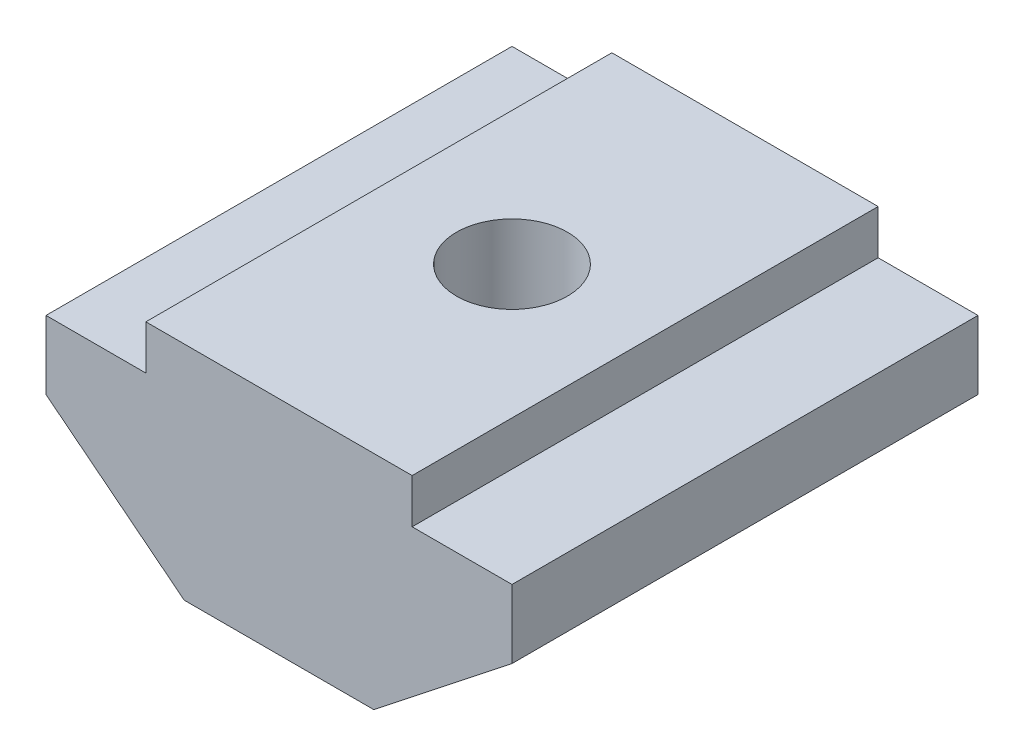
ISO-10303-21;
HEADER;
FILE_DESCRIPTION(('STEP AP214'),'2;1');
FILE_NAME('part.step','',(''),(''),'','','');
FILE_SCHEMA(('AUTOMOTIVE_DESIGN { 1 0 10303 214 1 1 1 1 }'));
ENDSEC;
DATA;
#1=APPLICATION_CONTEXT('core data for automotive mechanical design processes');
#2=APPLICATION_PROTOCOL_DEFINITION('international standard','automotive_design',2000,#1);
#3=PRODUCT_CONTEXT('',#1,'mechanical');
#4=PRODUCT('Part','Part','',(#3));
#5=PRODUCT_RELATED_PRODUCT_CATEGORY('part','',(#4));
#6=PRODUCT_DEFINITION_FORMATION('','',#4);
#7=PRODUCT_DEFINITION_CONTEXT('part definition',#1,'design');
#8=PRODUCT_DEFINITION('design','',#6,#7);
#9=PRODUCT_DEFINITION_SHAPE('','',#8);
#10=(LENGTH_UNIT() NAMED_UNIT(*) SI_UNIT(.MILLI.,.METRE.));
#11=(NAMED_UNIT(*) PLANE_ANGLE_UNIT() SI_UNIT($,.RADIAN.));
#12=(NAMED_UNIT(*) SI_UNIT($,.STERADIAN.) SOLID_ANGLE_UNIT());
#13=UNCERTAINTY_MEASURE_WITH_UNIT(LENGTH_MEASURE(1.E-05),#10,'distance_accuracy_value','');
#14=(GEOMETRIC_REPRESENTATION_CONTEXT(3) GLOBAL_UNCERTAINTY_ASSIGNED_CONTEXT((#13)) GLOBAL_UNIT_ASSIGNED_CONTEXT((#10,
#11,#12)) REPRESENTATION_CONTEXT('',''));
#15=CARTESIAN_POINT('',(0.,0.,0.));
#16=DIRECTION('',(0.,0.,1.));
#17=DIRECTION('',(1.,0.,0.));
#18=AXIS2_PLACEMENT_3D('',#15,#16,#17);
#19=CARTESIAN_POINT('',(3.,5.,10.5));
#20=DIRECTION('',(-1.,0.,0.));
#21=DIRECTION('',(0.,-1.,0.));
#22=AXIS2_PLACEMENT_3D('',#19,#20,#21);
#23=PLANE('',#22);
#24=DIRECTION('',(0.,1.,0.));
#25=VECTOR('',#24,1.);
#26=CARTESIAN_POINT('',(3.,5.,0.));
#27=LINE('',#26,#25);
#28=CARTESIAN_POINT('',(3.,4.,0.));
#29=VERTEX_POINT('',#28);
#30=CARTESIAN_POINT('',(3.,5.,0.));
#31=VERTEX_POINT('',#30);
#32=EDGE_CURVE('E177',#29,#31,#27,.T.);
#33=ORIENTED_EDGE('',*,*,#32,.T.);
#34=DIRECTION('',(0.,0.,-1.));
#35=VECTOR('',#34,1.);
#36=CARTESIAN_POINT('',(3.,5.,10.5));
#37=LINE('',#36,#35);
#38=CARTESIAN_POINT('',(3.,5.,10.5));
#39=VERTEX_POINT('',#38);
#40=EDGE_CURVE('E11',#39,#31,#37,.T.);
#41=ORIENTED_EDGE('',*,*,#40,.F.);
#42=DIRECTION('',(0.,1.,0.));
#43=VECTOR('',#42,1.);
#44=CARTESIAN_POINT('',(3.,5.,10.5));
#45=LINE('',#44,#43);
#46=CARTESIAN_POINT('',(3.,4.,10.5));
#47=VERTEX_POINT('',#46);
#48=EDGE_CURVE('E206',#47,#39,#45,.T.);
#49=ORIENTED_EDGE('',*,*,#48,.F.);
#50=DIRECTION('',(0.,0.,-1.));
#51=VECTOR('',#50,1.);
#52=CARTESIAN_POINT('',(3.,4.,10.5));
#53=LINE('',#52,#51);
#54=EDGE_CURVE('E173',#47,#29,#53,.T.);
#55=ORIENTED_EDGE('',*,*,#54,.T.);
#56=EDGE_LOOP('',(#33,#41,#49,#55));
#57=FACE_BOUND('',#56,.T.);
#58=ADVANCED_FACE('F44',(#57),#23,.F.);
#59=CARTESIAN_POINT('',(-3.,5.,10.5));
#60=DIRECTION('',(0.,-1.,0.));
#61=DIRECTION('',(0.,0.,-1.));
#62=AXIS2_PLACEMENT_3D('',#59,#60,#61);
#63=PLANE('',#62);
#64=CARTESIAN_POINT('',(0.,5.,5.24999999999998));
#65=DIRECTION('',(0.,1.,0.));
#66=DIRECTION('',(0.,0.,1.));
#67=AXIS2_PLACEMENT_3D('',#64,#65,#66);
#68=CIRCLE('',#67,1.25);
#69=CARTESIAN_POINT('',(0.,5.,6.49999999999998));
#70=VERTEX_POINT('',#69);
#71=EDGE_CURVE('E271',#70,#70,#68,.T.);
#72=ORIENTED_EDGE('',*,*,#71,.F.);
#73=EDGE_LOOP('',(#72));
#74=FACE_BOUND('',#73,.T.);
#75=DIRECTION('',(-1.,0.,0.));
#76=VECTOR('',#75,1.);
#77=CARTESIAN_POINT('',(-3.,5.,0.));
#78=LINE('',#77,#76);
#79=CARTESIAN_POINT('',(-3.,5.,0.));
#80=VERTEX_POINT('',#79);
#81=EDGE_CURVE('E181',#31,#80,#78,.T.);
#82=ORIENTED_EDGE('',*,*,#81,.T.);
#83=DIRECTION('',(0.,0.,-1.));
#84=VECTOR('',#83,1.);
#85=CARTESIAN_POINT('',(-3.,5.,10.5));
#86=LINE('',#85,#84);
#87=CARTESIAN_POINT('',(-3.,5.,10.5));
#88=VERTEX_POINT('',#87);
#89=EDGE_CURVE('E53',#88,#80,#86,.T.);
#90=ORIENTED_EDGE('',*,*,#89,.F.);
#91=DIRECTION('',(-1.,0.,0.));
#92=VECTOR('',#91,1.);
#93=CARTESIAN_POINT('',(-3.,5.,10.5));
#94=LINE('',#93,#92);
#95=EDGE_CURVE('E123',#39,#88,#94,.T.);
#96=ORIENTED_EDGE('',*,*,#95,.F.);
#97=ORIENTED_EDGE('',*,*,#40,.T.);
#98=EDGE_LOOP('',(#82,#90,#96,#97));
#99=FACE_BOUND('',#98,.T.);
#100=ADVANCED_FACE('F278',(#74,#99),#63,.F.);
#101=CARTESIAN_POINT('',(-3.,5.,10.5));
#102=DIRECTION('',(1.,0.,0.));
#103=DIRECTION('',(0.,1.,0.));
#104=AXIS2_PLACEMENT_3D('',#101,#102,#103);
#105=PLANE('',#104);
#106=DIRECTION('',(0.,-1.,0.));
#107=VECTOR('',#106,1.);
#108=CARTESIAN_POINT('',(-3.,5.,0.));
#109=LINE('',#108,#107);
#110=CARTESIAN_POINT('',(-3.,4.,0.));
#111=VERTEX_POINT('',#110);
#112=EDGE_CURVE('E185',#80,#111,#109,.T.);
#113=ORIENTED_EDGE('',*,*,#112,.T.);
#114=DIRECTION('',(0.,0.,-1.));
#115=VECTOR('',#114,1.);
#116=CARTESIAN_POINT('',(-3.,4.,10.5));
#117=LINE('',#116,#115);
#118=CARTESIAN_POINT('',(-3.,4.,10.5));
#119=VERTEX_POINT('',#118);
#120=EDGE_CURVE('E225',#119,#111,#117,.T.);
#121=ORIENTED_EDGE('',*,*,#120,.F.);
#122=DIRECTION('',(0.,-1.,0.));
#123=VECTOR('',#122,1.);
#124=CARTESIAN_POINT('',(-3.,5.,10.5));
#125=LINE('',#124,#123);
#126=EDGE_CURVE('E235',#88,#119,#125,.T.);
#127=ORIENTED_EDGE('',*,*,#126,.F.);
#128=ORIENTED_EDGE('',*,*,#89,.T.);
#129=EDGE_LOOP('',(#113,#121,#127,#128));
#130=FACE_BOUND('',#129,.T.);
#131=ADVANCED_FACE('F233',(#130),#105,.F.);
#132=CARTESIAN_POINT('',(-3.,4.,10.5));
#133=DIRECTION('',(0.,-1.,0.));
#134=DIRECTION('',(0.,0.,-1.));
#135=AXIS2_PLACEMENT_3D('',#132,#133,#134);
#136=PLANE('',#135);
#137=DIRECTION('',(-1.,0.,0.));
#138=VECTOR('',#137,1.);
#139=CARTESIAN_POINT('',(-3.,4.,0.));
#140=LINE('',#139,#138);
#141=CARTESIAN_POINT('',(-5.24999999999998,4.,0.));
#142=VERTEX_POINT('',#141);
#143=EDGE_CURVE('E188',#111,#142,#140,.T.);
#144=ORIENTED_EDGE('',*,*,#143,.T.);
#145=DIRECTION('',(0.,0.,-1.));
#146=VECTOR('',#145,1.);
#147=CARTESIAN_POINT('',(-5.24999999999998,4.,10.5));
#148=LINE('',#147,#146);
#149=CARTESIAN_POINT('',(-5.24999999999998,4.,10.5));
#150=VERTEX_POINT('',#149);
#151=EDGE_CURVE('E221',#150,#142,#148,.T.);
#152=ORIENTED_EDGE('',*,*,#151,.F.);
#153=DIRECTION('',(-1.,0.,0.));
#154=VECTOR('',#153,1.);
#155=CARTESIAN_POINT('',(-3.,4.,10.5));
#156=LINE('',#155,#154);
#157=EDGE_CURVE('E254',#119,#150,#156,.T.);
#158=ORIENTED_EDGE('',*,*,#157,.F.);
#159=ORIENTED_EDGE('',*,*,#120,.T.);
#160=EDGE_LOOP('',(#144,#152,#158,#159));
#161=FACE_BOUND('',#160,.T.);
#162=ADVANCED_FACE('F244',(#161),#136,.F.);
#163=CARTESIAN_POINT('',(-5.24999999999998,4.,10.5));
#164=DIRECTION('',(1.,0.,0.));
#165=DIRECTION('',(0.,0.,-1.));
#166=AXIS2_PLACEMENT_3D('',#163,#164,#165);
#167=PLANE('',#166);
#168=DIRECTION('',(0.,-1.,0.));
#169=VECTOR('',#168,1.);
#170=CARTESIAN_POINT('',(-5.24999999999998,4.,0.));
#171=LINE('',#170,#169);
#172=CARTESIAN_POINT('',(-5.24999999999998,2.45593869111821,0.));
#173=VERTEX_POINT('',#172);
#174=EDGE_CURVE('E191',#142,#173,#171,.T.);
#175=ORIENTED_EDGE('',*,*,#174,.T.);
#176=DIRECTION('',(0.,0.,-1.));
#177=VECTOR('',#176,1.);
#178=CARTESIAN_POINT('',(-5.24999999999998,2.45593869111821,10.5));
#179=LINE('',#178,#177);
#180=CARTESIAN_POINT('',(-5.24999999999998,2.45593869111821,10.5));
#181=VERTEX_POINT('',#180);
#182=EDGE_CURVE('E217',#181,#173,#179,.T.);
#183=ORIENTED_EDGE('',*,*,#182,.F.);
#184=DIRECTION('',(0.,-1.,0.));
#185=VECTOR('',#184,1.);
#186=CARTESIAN_POINT('',(-5.24999999999998,4.,10.5));
#187=LINE('',#186,#185);
#188=EDGE_CURVE('E250',#150,#181,#187,.T.);
#189=ORIENTED_EDGE('',*,*,#188,.F.);
#190=ORIENTED_EDGE('',*,*,#151,.T.);
#191=EDGE_LOOP('',(#175,#183,#189,#190));
#192=FACE_BOUND('',#191,.T.);
#193=ADVANCED_FACE('F248',(#192),#167,.F.);
#194=CARTESIAN_POINT('',(-5.24999999999998,2.45593869111821,10.5));
#195=DIRECTION('',(0.619208751305956,0.78522641467676,0.));
#196=DIRECTION('',(-0.78522641467676,0.619208751305956,0.));
#197=AXIS2_PLACEMENT_3D('',#194,#195,#196);
#198=PLANE('',#197);
#199=DIRECTION('',(0.78522641467676,-0.619208751305956,0.));
#200=VECTOR('',#199,1.);
#201=CARTESIAN_POINT('',(-5.24999999999998,2.45593869111821,0.));
#202=LINE('',#201,#200);
#203=CARTESIAN_POINT('',(-2.13559322033896,0.,0.));
#204=VERTEX_POINT('',#203);
#205=EDGE_CURVE('E194',#173,#204,#202,.T.);
#206=ORIENTED_EDGE('',*,*,#205,.T.);
#207=DIRECTION('',(0.,0.,-1.));
#208=VECTOR('',#207,1.);
#209=CARTESIAN_POINT('',(-2.13559322033896,0.,10.5));
#210=LINE('',#209,#208);
#211=CARTESIAN_POINT('',(-2.13559322033896,0.,10.5));
#212=VERTEX_POINT('',#211);
#213=EDGE_CURVE('E213',#212,#204,#210,.T.);
#214=ORIENTED_EDGE('',*,*,#213,.F.);
#215=DIRECTION('',(0.78522641467676,-0.619208751305956,0.));
#216=VECTOR('',#215,1.);
#217=CARTESIAN_POINT('',(-5.24999999999998,2.45593869111821,10.5));
#218=LINE('',#217,#216);
#219=EDGE_CURVE('E253',#181,#212,#218,.T.);
#220=ORIENTED_EDGE('',*,*,#219,.F.);
#221=ORIENTED_EDGE('',*,*,#182,.T.);
#222=EDGE_LOOP('',(#206,#214,#220,#221));
#223=FACE_BOUND('',#222,.T.);
#224=ADVANCED_FACE('F288',(#223),#198,.F.);
#225=CARTESIAN_POINT('',(2.13559322033896,0.,10.5));
#226=DIRECTION('',(0.,1.,0.));
#227=DIRECTION('',(0.,0.,1.));
#228=AXIS2_PLACEMENT_3D('',#225,#226,#227);
#229=PLANE('',#228);
#230=CARTESIAN_POINT('',(0.,0.,5.24999999999998));
#231=DIRECTION('',(0.,1.,0.));
#232=DIRECTION('',(0.,0.,1.));
#233=AXIS2_PLACEMENT_3D('',#230,#231,#232);
#234=CIRCLE('',#233,1.25);
#235=CARTESIAN_POINT('',(0.,0.,6.49999999999997));
#236=VERTEX_POINT('',#235);
#237=EDGE_CURVE('E182',#236,#236,#234,.T.);
#238=ORIENTED_EDGE('',*,*,#237,.T.);
#239=EDGE_LOOP('',(#238));
#240=FACE_BOUND('',#239,.T.);
#241=DIRECTION('',(1.,0.,0.));
#242=VECTOR('',#241,1.);
#243=CARTESIAN_POINT('',(2.13559322033896,0.,0.));
#244=LINE('',#243,#242);
#245=CARTESIAN_POINT('',(2.13559322033896,0.,0.));
#246=VERTEX_POINT('',#245);
#247=EDGE_CURVE('E197',#204,#246,#244,.T.);
#248=ORIENTED_EDGE('',*,*,#247,.T.);
#249=DIRECTION('',(0.,0.,-1.));
#250=VECTOR('',#249,1.);
#251=CARTESIAN_POINT('',(2.13559322033896,0.,10.5));
#252=LINE('',#251,#250);
#253=CARTESIAN_POINT('',(2.13559322033896,0.,10.5));
#254=VERTEX_POINT('',#253);
#255=EDGE_CURVE('E166',#254,#246,#252,.T.);
#256=ORIENTED_EDGE('',*,*,#255,.F.);
#257=DIRECTION('',(1.,0.,0.));
#258=VECTOR('',#257,1.);
#259=CARTESIAN_POINT('',(2.13559322033896,0.,10.5));
#260=LINE('',#259,#258);
#261=EDGE_CURVE('E155',#212,#254,#260,.T.);
#262=ORIENTED_EDGE('',*,*,#261,.F.);
#263=ORIENTED_EDGE('',*,*,#213,.T.);
#264=EDGE_LOOP('',(#248,#256,#262,#263));
#265=FACE_BOUND('',#264,.T.);
#266=ADVANCED_FACE('F285',(#240,#265),#229,.F.);
#267=CARTESIAN_POINT('',(5.24999999999998,2.45593869111821,10.5));
#268=DIRECTION('',(-0.619208751305956,0.78522641467676,0.));
#269=DIRECTION('',(-0.78522641467676,-0.619208751305956,0.));
#270=AXIS2_PLACEMENT_3D('',#267,#268,#269);
#271=PLANE('',#270);
#272=DIRECTION('',(0.78522641467676,0.619208751305956,0.));
#273=VECTOR('',#272,1.);
#274=CARTESIAN_POINT('',(5.24999999999998,2.45593869111821,0.));
#275=LINE('',#274,#273);
#276=CARTESIAN_POINT('',(5.24999999999998,2.45593869111821,0.));
#277=VERTEX_POINT('',#276);
#278=EDGE_CURVE('E164',#246,#277,#275,.T.);
#279=ORIENTED_EDGE('',*,*,#278,.T.);
#280=DIRECTION('',(0.,0.,-1.));
#281=VECTOR('',#280,1.);
#282=CARTESIAN_POINT('',(5.24999999999998,2.45593869111821,10.5));
#283=LINE('',#282,#281);
#284=CARTESIAN_POINT('',(5.24999999999998,2.45593869111821,10.5));
#285=VERTEX_POINT('',#284);
#286=EDGE_CURVE('E161',#285,#277,#283,.T.);
#287=ORIENTED_EDGE('',*,*,#286,.F.);
#288=DIRECTION('',(0.78522641467676,0.619208751305956,0.));
#289=VECTOR('',#288,1.);
#290=CARTESIAN_POINT('',(5.24999999999998,2.45593869111821,10.5));
#291=LINE('',#290,#289);
#292=EDGE_CURVE('E149',#254,#285,#291,.T.);
#293=ORIENTED_EDGE('',*,*,#292,.F.);
#294=ORIENTED_EDGE('',*,*,#255,.T.);
#295=EDGE_LOOP('',(#279,#287,#293,#294));
#296=FACE_BOUND('',#295,.T.);
#297=ADVANCED_FACE('F162',(#296),#271,.F.);
#298=CARTESIAN_POINT('',(5.24999999999998,4.,10.5));
#299=DIRECTION('',(-1.,0.,0.));
#300=DIRECTION('',(0.,0.,1.));
#301=AXIS2_PLACEMENT_3D('',#298,#299,#300);
#302=PLANE('',#301);
#303=DIRECTION('',(0.,1.,0.));
#304=VECTOR('',#303,1.);
#305=CARTESIAN_POINT('',(5.24999999999998,4.,0.));
#306=LINE('',#305,#304);
#307=CARTESIAN_POINT('',(5.24999999999998,4.,0.));
#308=VERTEX_POINT('',#307);
#309=EDGE_CURVE('E108',#277,#308,#306,.T.);
#310=ORIENTED_EDGE('',*,*,#309,.T.);
#311=DIRECTION('',(0.,0.,-1.));
#312=VECTOR('',#311,1.);
#313=CARTESIAN_POINT('',(5.24999999999998,4.,10.5));
#314=LINE('',#313,#312);
#315=CARTESIAN_POINT('',(5.24999999999998,4.,10.5));
#316=VERTEX_POINT('',#315);
#317=EDGE_CURVE('E167',#316,#308,#314,.T.);
#318=ORIENTED_EDGE('',*,*,#317,.F.);
#319=DIRECTION('',(0.,1.,0.));
#320=VECTOR('',#319,1.);
#321=CARTESIAN_POINT('',(5.24999999999998,4.,10.5));
#322=LINE('',#321,#320);
#323=EDGE_CURVE('E153',#285,#316,#322,.T.);
#324=ORIENTED_EDGE('',*,*,#323,.F.);
#325=ORIENTED_EDGE('',*,*,#286,.T.);
#326=EDGE_LOOP('',(#310,#318,#324,#325));
#327=FACE_BOUND('',#326,.T.);
#328=ADVANCED_FACE('F169',(#327),#302,.F.);
#329=CARTESIAN_POINT('',(3.,4.,10.5));
#330=DIRECTION('',(0.,-1.,0.));
#331=DIRECTION('',(0.,0.,-1.));
#332=AXIS2_PLACEMENT_3D('',#329,#330,#331);
#333=PLANE('',#332);
#334=DIRECTION('',(-1.,0.,0.));
#335=VECTOR('',#334,1.);
#336=CARTESIAN_POINT('',(3.,4.,0.));
#337=LINE('',#336,#335);
#338=EDGE_CURVE('E115',#308,#29,#337,.T.);
#339=ORIENTED_EDGE('',*,*,#338,.T.);
#340=ORIENTED_EDGE('',*,*,#54,.F.);
#341=DIRECTION('',(-1.,0.,0.));
#342=VECTOR('',#341,1.);
#343=CARTESIAN_POINT('',(3.,4.,10.5));
#344=LINE('',#343,#342);
#345=EDGE_CURVE('E64',#316,#47,#344,.T.);
#346=ORIENTED_EDGE('',*,*,#345,.F.);
#347=ORIENTED_EDGE('',*,*,#317,.T.);
#348=EDGE_LOOP('',(#339,#340,#346,#347));
#349=FACE_BOUND('',#348,.T.);
#350=ADVANCED_FACE('F360',(#349),#333,.F.);
#351=CARTESIAN_POINT('',(0.,0.,10.5));
#352=DIRECTION('',(0.,0.,1.));
#353=DIRECTION('',(1.,0.,0.));
#354=AXIS2_PLACEMENT_3D('',#351,#352,#353);
#355=PLANE('',#354);
#356=ORIENTED_EDGE('',*,*,#48,.T.);
#357=ORIENTED_EDGE('',*,*,#95,.T.);
#358=ORIENTED_EDGE('',*,*,#126,.T.);
#359=ORIENTED_EDGE('',*,*,#157,.T.);
#360=ORIENTED_EDGE('',*,*,#188,.T.);
#361=ORIENTED_EDGE('',*,*,#219,.T.);
#362=ORIENTED_EDGE('',*,*,#261,.T.);
#363=ORIENTED_EDGE('',*,*,#292,.T.);
#364=ORIENTED_EDGE('',*,*,#323,.T.);
#365=ORIENTED_EDGE('',*,*,#345,.T.);
#366=EDGE_LOOP('',(#356,#357,#358,#359,#360,#361,#362,#363,#364,#365));
#367=FACE_BOUND('',#366,.T.);
#368=ADVANCED_FACE('F151',(#367),#355,.T.);
#369=CARTESIAN_POINT('',(0.,0.,0.));
#370=DIRECTION('',(0.,0.,1.));
#371=DIRECTION('',(1.,0.,0.));
#372=AXIS2_PLACEMENT_3D('',#369,#370,#371);
#373=PLANE('',#372);
#374=ORIENTED_EDGE('',*,*,#32,.F.);
#375=ORIENTED_EDGE('',*,*,#338,.F.);
#376=ORIENTED_EDGE('',*,*,#309,.F.);
#377=ORIENTED_EDGE('',*,*,#278,.F.);
#378=ORIENTED_EDGE('',*,*,#247,.F.);
#379=ORIENTED_EDGE('',*,*,#205,.F.);
#380=ORIENTED_EDGE('',*,*,#174,.F.);
#381=ORIENTED_EDGE('',*,*,#143,.F.);
#382=ORIENTED_EDGE('',*,*,#112,.F.);
#383=ORIENTED_EDGE('',*,*,#81,.F.);
#384=EDGE_LOOP('',(#374,#375,#376,#377,#378,#379,#380,#381,#382,#383));
#385=FACE_BOUND('',#384,.T.);
#386=ADVANCED_FACE('F239',(#385),#373,.F.);
#387=CARTESIAN_POINT('',(0.,5.,5.24999999999998));
#388=DIRECTION('',(0.,1.,0.));
#389=DIRECTION('',(0.,0.,1.));
#390=AXIS2_PLACEMENT_3D('',#387,#388,#389);
#391=CYLINDRICAL_SURFACE('',#390,1.25);
#392=ORIENTED_EDGE('',*,*,#237,.F.);
#393=EDGE_LOOP('',(#392));
#394=FACE_BOUND('',#393,.T.);
#395=ORIENTED_EDGE('',*,*,#71,.T.);
#396=EDGE_LOOP('',(#395));
#397=FACE_BOUND('',#396,.T.);
#398=ADVANCED_FACE('F276',(#394,#397),#391,.F.);
#399=CLOSED_SHELL('',(#58,#100,#131,#162,#193,#224,#266,#297,#328,#350,#368,#386,#398));
#400=MANIFOLD_SOLID_BREP('B2',#399);
#401=ADVANCED_BREP_SHAPE_REPRESENTATION('',(#18,#400),#14);
#402=SHAPE_DEFINITION_REPRESENTATION(#9,#401);
ENDSEC;
END-ISO-10303-21;
